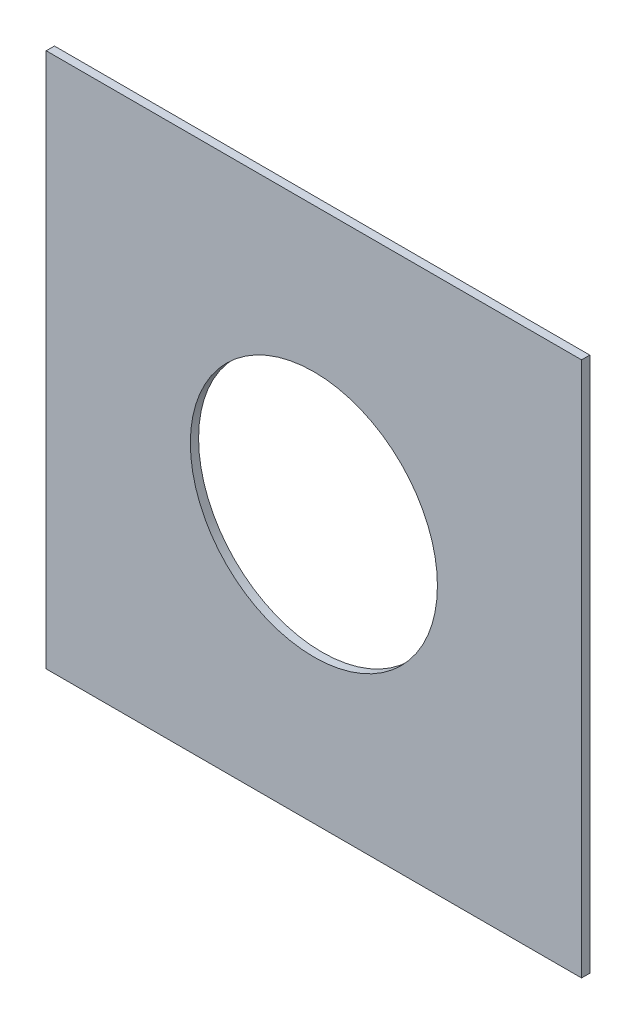
ISO-10303-21;
HEADER;
FILE_DESCRIPTION(('STEP AP214'),'2;1');
FILE_NAME('part.step','',(''),(''),'','','');
FILE_SCHEMA(('AUTOMOTIVE_DESIGN { 1 0 10303 214 1 1 1 1 }'));
ENDSEC;
DATA;
#1=APPLICATION_CONTEXT('core data for automotive mechanical design processes');
#2=APPLICATION_PROTOCOL_DEFINITION('international standard','automotive_design',2000,#1);
#3=PRODUCT_CONTEXT('',#1,'mechanical');
#4=PRODUCT('Part','Part','',(#3));
#5=PRODUCT_RELATED_PRODUCT_CATEGORY('part','',(#4));
#6=PRODUCT_DEFINITION_FORMATION('','',#4);
#7=PRODUCT_DEFINITION_CONTEXT('part definition',#1,'design');
#8=PRODUCT_DEFINITION('design','',#6,#7);
#9=PRODUCT_DEFINITION_SHAPE('','',#8);
#10=(LENGTH_UNIT() NAMED_UNIT(*) SI_UNIT(.MILLI.,.METRE.));
#11=(NAMED_UNIT(*) PLANE_ANGLE_UNIT() SI_UNIT($,.RADIAN.));
#12=(NAMED_UNIT(*) SI_UNIT($,.STERADIAN.) SOLID_ANGLE_UNIT());
#13=UNCERTAINTY_MEASURE_WITH_UNIT(LENGTH_MEASURE(1.E-05),#10,'distance_accuracy_value','');
#14=(GEOMETRIC_REPRESENTATION_CONTEXT(3) GLOBAL_UNCERTAINTY_ASSIGNED_CONTEXT((#13)) GLOBAL_UNIT_ASSIGNED_CONTEXT((#10,
#11,#12)) REPRESENTATION_CONTEXT('',''));
#15=CARTESIAN_POINT('',(0.,0.,0.));
#16=DIRECTION('',(0.,0.,1.));
#17=DIRECTION('',(1.,0.,0.));
#18=AXIS2_PLACEMENT_3D('',#15,#16,#17);
#19=CARTESIAN_POINT('',(0.573999999999999,-3.55,-6.999));
#20=DIRECTION('',(0.,1.,0.));
#21=DIRECTION('',(1.,0.,0.));
#22=AXIS2_PLACEMENT_3D('',#19,#20,#21);
#23=PLANE('',#22);
#24=DIRECTION('',(0.,0.,1.));
#25=VECTOR('',#24,1.);
#26=CARTESIAN_POINT('',(1.875,-3.55,-7.01));
#27=LINE('',#26,#25);
#28=CARTESIAN_POINT('',(1.875,-3.55,-7.02));
#29=VERTEX_POINT('',#28);
#30=CARTESIAN_POINT('',(1.875,-3.55,-7.));
#31=VERTEX_POINT('',#30);
#32=EDGE_CURVE('E62',#29,#31,#27,.T.);
#33=ORIENTED_EDGE('',*,*,#32,.F.);
#34=DIRECTION('',(1.,0.,0.));
#35=VECTOR('',#34,1.);
#36=CARTESIAN_POINT('',(1.225,-3.55,-7.02));
#37=LINE('',#36,#35);
#38=CARTESIAN_POINT('',(0.575,-3.55,-7.02));
#39=VERTEX_POINT('',#38);
#40=EDGE_CURVE('E87',#39,#29,#37,.T.);
#41=ORIENTED_EDGE('',*,*,#40,.F.);
#42=DIRECTION('',(0.,0.,-1.));
#43=VECTOR('',#42,1.);
#44=CARTESIAN_POINT('',(0.575,-3.55,-7.01));
#45=LINE('',#44,#43);
#46=CARTESIAN_POINT('',(0.575,-3.55,-7.));
#47=VERTEX_POINT('',#46);
#48=EDGE_CURVE('E73',#47,#39,#45,.T.);
#49=ORIENTED_EDGE('',*,*,#48,.F.);
#50=DIRECTION('',(-1.,0.,0.));
#51=VECTOR('',#50,1.);
#52=CARTESIAN_POINT('',(1.225,-3.55,-7.));
#53=LINE('',#52,#51);
#54=EDGE_CURVE('E56',#31,#47,#53,.T.);
#55=ORIENTED_EDGE('',*,*,#54,.F.);
#56=EDGE_LOOP('',(#33,#41,#49,#55));
#57=FACE_BOUND('',#56,.T.);
#58=ADVANCED_FACE('F17',(#57),#23,.T.);
#59=CARTESIAN_POINT('',(1.875,-3.549,-6.999));
#60=DIRECTION('',(1.,0.,0.));
#61=DIRECTION('',(0.,-1.,0.));
#62=AXIS2_PLACEMENT_3D('',#59,#60,#61);
#63=PLANE('',#62);
#64=DIRECTION('',(0.,0.,-1.));
#65=VECTOR('',#64,1.);
#66=CARTESIAN_POINT('',(1.875,-4.85,-7.01));
#67=LINE('',#66,#65);
#68=CARTESIAN_POINT('',(1.875,-4.85,-7.));
#69=VERTEX_POINT('',#68);
#70=CARTESIAN_POINT('',(1.875,-4.85,-7.02));
#71=VERTEX_POINT('',#70);
#72=EDGE_CURVE('E71',#69,#71,#67,.T.);
#73=ORIENTED_EDGE('',*,*,#72,.T.);
#74=DIRECTION('',(0.,-1.,0.));
#75=VECTOR('',#74,1.);
#76=CARTESIAN_POINT('',(1.875,-4.2,-7.02));
#77=LINE('',#76,#75);
#78=EDGE_CURVE('E67',#29,#71,#77,.T.);
#79=ORIENTED_EDGE('',*,*,#78,.F.);
#80=ORIENTED_EDGE('',*,*,#32,.T.);
#81=DIRECTION('',(0.,1.,0.));
#82=VECTOR('',#81,1.);
#83=CARTESIAN_POINT('',(1.875,-4.2,-7.));
#84=LINE('',#83,#82);
#85=EDGE_CURVE('E64',#69,#31,#84,.T.);
#86=ORIENTED_EDGE('',*,*,#85,.F.);
#87=EDGE_LOOP('',(#73,#79,#80,#86));
#88=FACE_BOUND('',#87,.T.);
#89=ADVANCED_FACE('F63',(#88),#63,.T.);
#90=CARTESIAN_POINT('',(1.225,-4.2,-7.));
#91=DIRECTION('',(0.,0.,-1.));
#92=DIRECTION('',(-1.,0.,0.));
#93=AXIS2_PLACEMENT_3D('',#90,#91,#92);
#94=CYLINDRICAL_SURFACE('',#93,0.300000000000001);
#95=CARTESIAN_POINT('',(1.225,-4.2,-7.02));
#96=DIRECTION('',(0.,0.,-1.));
#97=DIRECTION('',(-1.,0.,0.));
#98=AXIS2_PLACEMENT_3D('',#95,#96,#97);
#99=CIRCLE('',#98,0.300000000000001);
#100=CARTESIAN_POINT('',(0.924999999999998,-4.2,-7.02));
#101=VERTEX_POINT('',#100);
#102=EDGE_CURVE('E82',#101,#101,#99,.F.);
#103=ORIENTED_EDGE('',*,*,#102,.F.);
#104=EDGE_LOOP('',(#103));
#105=FACE_BOUND('',#104,.T.);
#106=CARTESIAN_POINT('',(1.225,-4.2,-7.));
#107=DIRECTION('',(0.,0.,-1.));
#108=DIRECTION('',(-1.,0.,0.));
#109=AXIS2_PLACEMENT_3D('',#106,#107,#108);
#110=CIRCLE('',#109,0.300000000000001);
#111=CARTESIAN_POINT('',(0.924999999999998,-4.2,-7.));
#112=VERTEX_POINT('',#111);
#113=EDGE_CURVE('E21',#112,#112,#110,.T.);
#114=ORIENTED_EDGE('',*,*,#113,.F.);
#115=EDGE_LOOP('',(#114));
#116=FACE_BOUND('',#115,.T.);
#117=ADVANCED_FACE('F99',(#105,#116),#94,.F.);
#118=CARTESIAN_POINT('',(1.876,-3.549,-7.));
#119=DIRECTION('',(0.,0.,1.));
#120=DIRECTION('',(-1.,0.,0.));
#121=AXIS2_PLACEMENT_3D('',#118,#119,#120);
#122=PLANE('',#121);
#123=ORIENTED_EDGE('',*,*,#113,.T.);
#124=EDGE_LOOP('',(#123));
#125=FACE_BOUND('',#124,.T.);
#126=DIRECTION('',(0.,1.,0.));
#127=VECTOR('',#126,1.);
#128=CARTESIAN_POINT('',(0.575,-4.2,-7.));
#129=LINE('',#128,#127);
#130=CARTESIAN_POINT('',(0.575,-4.85,-7.));
#131=VERTEX_POINT('',#130);
#132=EDGE_CURVE('E94',#131,#47,#129,.T.);
#133=ORIENTED_EDGE('',*,*,#132,.F.);
#134=DIRECTION('',(-1.,0.,0.));
#135=VECTOR('',#134,1.);
#136=CARTESIAN_POINT('',(1.225,-4.85,-7.));
#137=LINE('',#136,#135);
#138=EDGE_CURVE('E78',#69,#131,#137,.T.);
#139=ORIENTED_EDGE('',*,*,#138,.F.);
#140=ORIENTED_EDGE('',*,*,#85,.T.);
#141=ORIENTED_EDGE('',*,*,#54,.T.);
#142=EDGE_LOOP('',(#133,#139,#140,#141));
#143=FACE_BOUND('',#142,.T.);
#144=ADVANCED_FACE('F76',(#125,#143),#122,.T.);
#145=CARTESIAN_POINT('',(0.575,-4.851,-6.999));
#146=DIRECTION('',(-1.,0.,0.));
#147=DIRECTION('',(0.,1.,0.));
#148=AXIS2_PLACEMENT_3D('',#145,#146,#147);
#149=PLANE('',#148);
#150=ORIENTED_EDGE('',*,*,#48,.T.);
#151=DIRECTION('',(0.,1.,0.));
#152=VECTOR('',#151,1.);
#153=CARTESIAN_POINT('',(0.575,-4.2,-7.02));
#154=LINE('',#153,#152);
#155=CARTESIAN_POINT('',(0.575,-4.85,-7.02));
#156=VERTEX_POINT('',#155);
#157=EDGE_CURVE('E36',#156,#39,#154,.T.);
#158=ORIENTED_EDGE('',*,*,#157,.F.);
#159=DIRECTION('',(0.,0.,-1.));
#160=VECTOR('',#159,1.);
#161=CARTESIAN_POINT('',(0.575,-4.85,-7.01));
#162=LINE('',#161,#160);
#163=EDGE_CURVE('E27',#131,#156,#162,.T.);
#164=ORIENTED_EDGE('',*,*,#163,.F.);
#165=ORIENTED_EDGE('',*,*,#132,.T.);
#166=EDGE_LOOP('',(#150,#158,#164,#165));
#167=FACE_BOUND('',#166,.T.);
#168=ADVANCED_FACE('F108',(#167),#149,.T.);
#169=CARTESIAN_POINT('',(0.574,-3.549,-7.02));
#170=DIRECTION('',(0.,0.,-1.));
#171=DIRECTION('',(1.,0.,0.));
#172=AXIS2_PLACEMENT_3D('',#169,#170,#171);
#173=PLANE('',#172);
#174=ORIENTED_EDGE('',*,*,#102,.T.);
#175=EDGE_LOOP('',(#174));
#176=FACE_BOUND('',#175,.T.);
#177=ORIENTED_EDGE('',*,*,#40,.T.);
#178=ORIENTED_EDGE('',*,*,#78,.T.);
#179=DIRECTION('',(1.,0.,0.));
#180=VECTOR('',#179,1.);
#181=CARTESIAN_POINT('',(1.225,-4.85,-7.02));
#182=LINE('',#181,#180);
#183=EDGE_CURVE('E11',#156,#71,#182,.T.);
#184=ORIENTED_EDGE('',*,*,#183,.F.);
#185=ORIENTED_EDGE('',*,*,#157,.T.);
#186=EDGE_LOOP('',(#177,#178,#184,#185));
#187=FACE_BOUND('',#186,.T.);
#188=ADVANCED_FACE('F112',(#176,#187),#173,.T.);
#189=CARTESIAN_POINT('',(1.876,-4.85,-6.999));
#190=DIRECTION('',(0.,-1.,0.));
#191=DIRECTION('',(-1.,0.,0.));
#192=AXIS2_PLACEMENT_3D('',#189,#190,#191);
#193=PLANE('',#192);
#194=ORIENTED_EDGE('',*,*,#163,.T.);
#195=ORIENTED_EDGE('',*,*,#183,.T.);
#196=ORIENTED_EDGE('',*,*,#72,.F.);
#197=ORIENTED_EDGE('',*,*,#138,.T.);
#198=EDGE_LOOP('',(#194,#195,#196,#197));
#199=FACE_BOUND('',#198,.T.);
#200=ADVANCED_FACE('F19',(#199),#193,.T.);
#201=CLOSED_SHELL('',(#58,#89,#117,#144,#168,#188,#200));
#202=MANIFOLD_SOLID_BREP('B1',#201);
#203=ADVANCED_BREP_SHAPE_REPRESENTATION('',(#18,#202),#14);
#204=SHAPE_DEFINITION_REPRESENTATION(#9,#203);
ENDSEC;
END-ISO-10303-21;
